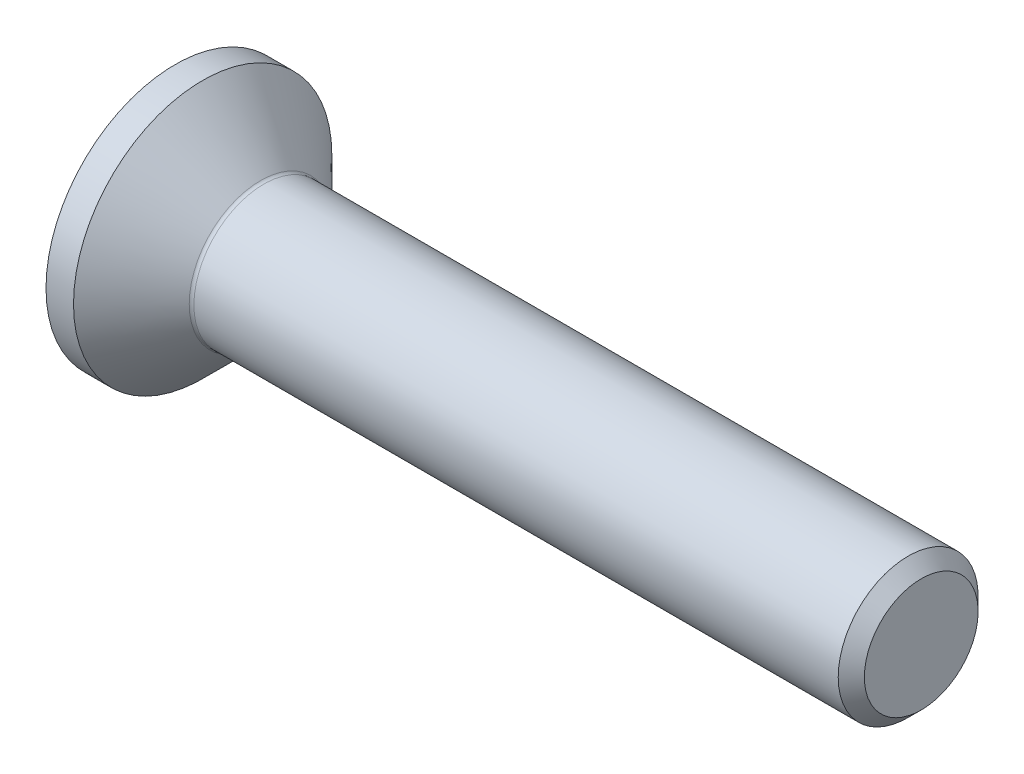
ISO-10303-21;
HEADER;
FILE_DESCRIPTION(('STEP AP214'),'2;1');
FILE_NAME('part.step','',(''),(''),'','','');
FILE_SCHEMA(('AUTOMOTIVE_DESIGN { 1 0 10303 214 1 1 1 1 }'));
ENDSEC;
DATA;
#1=APPLICATION_CONTEXT('core data for automotive mechanical design processes');
#2=APPLICATION_PROTOCOL_DEFINITION('international standard','automotive_design',2000,#1);
#3=PRODUCT_CONTEXT('',#1,'mechanical');
#4=PRODUCT('Part','Part','',(#3));
#5=PRODUCT_RELATED_PRODUCT_CATEGORY('part','',(#4));
#6=PRODUCT_DEFINITION_FORMATION('','',#4);
#7=PRODUCT_DEFINITION_CONTEXT('part definition',#1,'design');
#8=PRODUCT_DEFINITION('design','',#6,#7);
#9=PRODUCT_DEFINITION_SHAPE('','',#8);
#10=(LENGTH_UNIT() NAMED_UNIT(*) SI_UNIT(.MILLI.,.METRE.));
#11=(NAMED_UNIT(*) PLANE_ANGLE_UNIT() SI_UNIT($,.RADIAN.));
#12=(NAMED_UNIT(*) SI_UNIT($,.STERADIAN.) SOLID_ANGLE_UNIT());
#13=UNCERTAINTY_MEASURE_WITH_UNIT(LENGTH_MEASURE(1.E-05),#10,'distance_accuracy_value','');
#14=(GEOMETRIC_REPRESENTATION_CONTEXT(3) GLOBAL_UNCERTAINTY_ASSIGNED_CONTEXT((#13)) GLOBAL_UNIT_ASSIGNED_CONTEXT((#10,
#11,#12)) REPRESENTATION_CONTEXT('',''));
#15=CARTESIAN_POINT('',(0.,0.,0.));
#16=DIRECTION('',(0.,0.,1.));
#17=DIRECTION('',(1.,0.,0.));
#18=AXIS2_PLACEMENT_3D('',#15,#16,#17);
#19=CARTESIAN_POINT('',(0.,0.,0.));
#20=DIRECTION('',(-1.,0.,0.));
#21=DIRECTION('',(0.,0.,1.));
#22=AXIS2_PLACEMENT_3D('',#19,#20,#21);
#23=PLANE('',#22);
#24=CARTESIAN_POINT('',(0.,0.,0.));
#25=DIRECTION('',(-1.,0.,0.));
#26=DIRECTION('',(0.,0.,1.));
#27=AXIS2_PLACEMENT_3D('',#24,#25,#26);
#28=CIRCLE('',#27,2.77);
#29=CARTESIAN_POINT('',(0.,0.,2.77));
#30=VERTEX_POINT('',#29);
#31=EDGE_CURVE('E155',#30,#30,#28,.T.);
#32=ORIENTED_EDGE('',*,*,#31,.T.);
#33=EDGE_LOOP('',(#32));
#34=FACE_BOUND('',#33,.T.);
#35=DIRECTION('',(0.,-0.5,-0.866025403784439));
#36=VECTOR('',#35,1.);
#37=CARTESIAN_POINT('',(0.,-0.577350269189625,1.));
#38=LINE('',#37,#36);
#39=CARTESIAN_POINT('',(0.,-0.577350269189625,1.));
#40=VERTEX_POINT('',#39);
#41=CARTESIAN_POINT('',(0.,-1.15470053837925,0.));
#42=VERTEX_POINT('',#41);
#43=EDGE_CURVE('E121',#40,#42,#38,.T.);
#44=ORIENTED_EDGE('',*,*,#43,.T.);
#45=DIRECTION('',(0.,0.5,-0.866025403784439));
#46=VECTOR('',#45,1.);
#47=CARTESIAN_POINT('',(0.,-1.15470053837925,0.));
#48=LINE('',#47,#46);
#49=CARTESIAN_POINT('',(0.,-0.577350269189625,-1.));
#50=VERTEX_POINT('',#49);
#51=EDGE_CURVE('E52',#42,#50,#48,.T.);
#52=ORIENTED_EDGE('',*,*,#51,.T.);
#53=DIRECTION('',(0.,1.,0.));
#54=VECTOR('',#53,1.);
#55=CARTESIAN_POINT('',(0.,-0.577350269189625,-1.));
#56=LINE('',#55,#54);
#57=CARTESIAN_POINT('',(0.,0.577350269189626,-1.));
#58=VERTEX_POINT('',#57);
#59=EDGE_CURVE('E132',#50,#58,#56,.T.);
#60=ORIENTED_EDGE('',*,*,#59,.T.);
#61=DIRECTION('',(0.,0.500000000000001,0.866025403784438));
#62=VECTOR('',#61,1.);
#63=CARTESIAN_POINT('',(0.,0.577350269189626,-1.));
#64=LINE('',#63,#62);
#65=CARTESIAN_POINT('',(0.,1.15470053837925,0.));
#66=VERTEX_POINT('',#65);
#67=EDGE_CURVE('E256',#58,#66,#64,.T.);
#68=ORIENTED_EDGE('',*,*,#67,.T.);
#69=DIRECTION('',(0.,-0.5,0.866025403784438));
#70=VECTOR('',#69,1.);
#71=CARTESIAN_POINT('',(0.,1.15470053837925,0.));
#72=LINE('',#71,#70);
#73=CARTESIAN_POINT('',(0.,0.577350269189626,1.));
#74=VERTEX_POINT('',#73);
#75=EDGE_CURVE('E259',#66,#74,#72,.T.);
#76=ORIENTED_EDGE('',*,*,#75,.T.);
#77=DIRECTION('',(0.,-1.,0.));
#78=VECTOR('',#77,1.);
#79=CARTESIAN_POINT('',(0.,0.577350269189626,1.));
#80=LINE('',#79,#78);
#81=EDGE_CURVE('E262',#74,#40,#80,.T.);
#82=ORIENTED_EDGE('',*,*,#81,.T.);
#83=EDGE_LOOP('',(#44,#52,#60,#68,#76,#82));
#84=FACE_BOUND('',#83,.T.);
#85=ADVANCED_FACE('F37',(#34,#84),#23,.T.);
#86=CARTESIAN_POINT('',(0.,0.,0.));
#87=DIRECTION('',(-1.,0.,0.));
#88=DIRECTION('',(0.,0.,1.));
#89=AXIS2_PLACEMENT_3D('',#86,#87,#88);
#90=CYLINDRICAL_SURFACE('',#89,2.77);
#91=CARTESIAN_POINT('',(0.590000000000007,0.,0.));
#92=DIRECTION('',(-1.,0.,0.));
#93=DIRECTION('',(0.,0.,1.));
#94=AXIS2_PLACEMENT_3D('',#91,#92,#93);
#95=CIRCLE('',#94,2.77);
#96=CARTESIAN_POINT('',(0.590000000000007,0.,2.77));
#97=VERTEX_POINT('',#96);
#98=EDGE_CURVE('E152',#97,#97,#95,.T.);
#99=ORIENTED_EDGE('',*,*,#98,.T.);
#100=EDGE_LOOP('',(#99));
#101=FACE_BOUND('',#100,.T.);
#102=ORIENTED_EDGE('',*,*,#31,.F.);
#103=EDGE_LOOP('',(#102));
#104=FACE_BOUND('',#103,.T.);
#105=ADVANCED_FACE('F176',(#101,#104),#90,.T.);
#106=CARTESIAN_POINT('',(0.590000000000007,0.,0.));
#107=DIRECTION('',(-1.,0.,0.));
#108=DIRECTION('',(0.,0.,1.));
#109=AXIS2_PLACEMENT_3D('',#106,#107,#108);
#110=CONICAL_SURFACE('',#109,2.77,0.78539816339745);
#111=CARTESIAN_POINT('',(1.83071067811866,0.,0.));
#112=DIRECTION('',(-1.,0.,0.));
#113=DIRECTION('',(0.,0.,1.));
#114=AXIS2_PLACEMENT_3D('',#111,#112,#113);
#115=CIRCLE('',#114,1.52928932188135);
#116=CARTESIAN_POINT('',(1.83071067811866,0.,1.52928932188135));
#117=VERTEX_POINT('',#116);
#118=EDGE_CURVE('E45',#117,#117,#115,.T.);
#119=ORIENTED_EDGE('',*,*,#118,.T.);
#120=EDGE_LOOP('',(#119));
#121=FACE_BOUND('',#120,.T.);
#122=ORIENTED_EDGE('',*,*,#98,.F.);
#123=EDGE_LOOP('',(#122));
#124=FACE_BOUND('',#123,.T.);
#125=ADVANCED_FACE('F160',(#121,#124),#110,.T.);
#126=CARTESIAN_POINT('',(0.,0.,0.));
#127=DIRECTION('',(-1.,0.,0.));
#128=DIRECTION('',(0.,0.,1.));
#129=AXIS2_PLACEMENT_3D('',#126,#127,#128);
#130=CYLINDRICAL_SURFACE('',#129,1.5);
#131=CARTESIAN_POINT('',(1.90142135623731,0.,0.));
#132=DIRECTION('',(-1.,0.,0.));
#133=DIRECTION('',(0.,0.,1.));
#134=AXIS2_PLACEMENT_3D('',#131,#132,#133);
#135=CIRCLE('',#134,1.5);
#136=CARTESIAN_POINT('',(1.90142135623731,0.,1.5));
#137=VERTEX_POINT('',#136);
#138=EDGE_CURVE('E11',#137,#137,#135,.F.);
#139=ORIENTED_EDGE('',*,*,#138,.T.);
#140=EDGE_LOOP('',(#139));
#141=FACE_BOUND('',#140,.T.);
#142=CARTESIAN_POINT('',(15.7195,0.,0.));
#143=DIRECTION('',(-1.,0.,0.));
#144=DIRECTION('',(0.,0.,1.));
#145=AXIS2_PLACEMENT_3D('',#142,#143,#144);
#146=CIRCLE('',#145,1.5);
#147=CARTESIAN_POINT('',(15.7195,0.,1.5));
#148=VERTEX_POINT('',#147);
#149=EDGE_CURVE('E149',#148,#148,#146,.T.);
#150=ORIENTED_EDGE('',*,*,#149,.T.);
#151=EDGE_LOOP('',(#150));
#152=FACE_BOUND('',#151,.T.);
#153=ADVANCED_FACE('F187',(#141,#152),#130,.T.);
#154=CARTESIAN_POINT('',(16.,0.,0.));
#155=DIRECTION('',(-1.,0.,0.));
#156=DIRECTION('',(0.,0.,1.));
#157=AXIS2_PLACEMENT_3D('',#154,#155,#156);
#158=CONICAL_SURFACE('',#157,1.2195,0.785398163397475);
#159=ORIENTED_EDGE('',*,*,#149,.F.);
#160=EDGE_LOOP('',(#159));
#161=FACE_BOUND('',#160,.T.);
#162=CARTESIAN_POINT('',(16.,0.,0.));
#163=DIRECTION('',(-1.,0.,0.));
#164=DIRECTION('',(0.,0.,1.));
#165=AXIS2_PLACEMENT_3D('',#162,#163,#164);
#166=CIRCLE('',#165,1.2195);
#167=CARTESIAN_POINT('',(16.,0.,1.2195));
#168=VERTEX_POINT('',#167);
#169=EDGE_CURVE('E145',#168,#168,#166,.T.);
#170=ORIENTED_EDGE('',*,*,#169,.T.);
#171=EDGE_LOOP('',(#170));
#172=FACE_BOUND('',#171,.T.);
#173=ADVANCED_FACE('F171',(#161,#172),#158,.T.);
#174=CARTESIAN_POINT('',(16.,1.2195,0.));
#175=DIRECTION('',(1.,0.,0.));
#176=DIRECTION('',(0.,0.,-1.));
#177=AXIS2_PLACEMENT_3D('',#174,#175,#176);
#178=PLANE('',#177);
#179=ORIENTED_EDGE('',*,*,#169,.F.);
#180=EDGE_LOOP('',(#179));
#181=FACE_BOUND('',#180,.T.);
#182=ADVANCED_FACE('F164',(#181),#178,.T.);
#183=CARTESIAN_POINT('',(1.90142135623731,0.,0.));
#184=DIRECTION('',(-1.,0.,0.));
#185=DIRECTION('',(0.,0.,1.));
#186=AXIS2_PLACEMENT_3D('',#183,#184,#185);
#187=TOROIDAL_SURFACE('',#186,1.6,0.1);
#188=ORIENTED_EDGE('',*,*,#138,.F.);
#189=EDGE_LOOP('',(#188));
#190=FACE_BOUND('',#189,.T.);
#191=ORIENTED_EDGE('',*,*,#118,.F.);
#192=EDGE_LOOP('',(#191));
#193=FACE_BOUND('',#192,.T.);
#194=ADVANCED_FACE('F39',(#190,#193),#187,.F.);
#195=CARTESIAN_POINT('',(1.1,-1.15470053837925,0.));
#196=DIRECTION('',(0.,0.866025403784439,0.5));
#197=DIRECTION('',(0.,-0.5,0.866025403784439));
#198=AXIS2_PLACEMENT_3D('',#195,#196,#197);
#199=PLANE('',#198);
#200=ORIENTED_EDGE('',*,*,#51,.F.);
#201=DIRECTION('',(-1.,0.,0.));
#202=VECTOR('',#201,1.);
#203=CARTESIAN_POINT('',(1.1,-1.15470053837925,0.));
#204=LINE('',#203,#202);
#205=CARTESIAN_POINT('',(1.1,-1.15470053837925,0.));
#206=VERTEX_POINT('',#205);
#207=EDGE_CURVE('E253',#206,#42,#204,.T.);
#208=ORIENTED_EDGE('',*,*,#207,.F.);
#209=DIRECTION('',(0.,0.5,-0.866025403784439));
#210=VECTOR('',#209,1.);
#211=CARTESIAN_POINT('',(1.1,-1.15470053837925,0.));
#212=LINE('',#211,#210);
#213=CARTESIAN_POINT('',(1.1,-0.866025403784438,-0.5));
#214=VERTEX_POINT('',#213);
#215=EDGE_CURVE('E117',#206,#214,#212,.T.);
#216=ORIENTED_EDGE('',*,*,#215,.T.);
#217=CARTESIAN_POINT('',(1.1,-0.577350269189625,-1.));
#218=VERTEX_POINT('',#217);
#219=EDGE_CURVE('E113',#214,#218,#212,.T.);
#220=ORIENTED_EDGE('',*,*,#219,.T.);
#221=DIRECTION('',(-1.,0.,0.));
#222=VECTOR('',#221,1.);
#223=CARTESIAN_POINT('',(1.1,-0.577350269189625,-1.));
#224=LINE('',#223,#222);
#225=EDGE_CURVE('E115',#218,#50,#224,.T.);
#226=ORIENTED_EDGE('',*,*,#225,.T.);
#227=EDGE_LOOP('',(#200,#208,#216,#220,#226));
#228=FACE_BOUND('',#227,.T.);
#229=ADVANCED_FACE('F114',(#228),#199,.T.);
#230=CARTESIAN_POINT('',(1.1,-0.577350269189625,-1.));
#231=DIRECTION('',(0.,0.,1.));
#232=DIRECTION('',(1.,0.,0.));
#233=AXIS2_PLACEMENT_3D('',#230,#231,#232);
#234=PLANE('',#233);
#235=ORIENTED_EDGE('',*,*,#59,.F.);
#236=ORIENTED_EDGE('',*,*,#225,.F.);
#237=DIRECTION('',(0.,1.,0.));
#238=VECTOR('',#237,1.);
#239=CARTESIAN_POINT('',(1.1,-0.577350269189625,-1.));
#240=LINE('',#239,#238);
#241=CARTESIAN_POINT('',(1.1,0.,-1.));
#242=VERTEX_POINT('',#241);
#243=EDGE_CURVE('E60',#218,#242,#240,.T.);
#244=ORIENTED_EDGE('',*,*,#243,.T.);
#245=CARTESIAN_POINT('',(1.1,0.577350269189626,-1.));
#246=VERTEX_POINT('',#245);
#247=EDGE_CURVE('E127',#242,#246,#240,.T.);
#248=ORIENTED_EDGE('',*,*,#247,.T.);
#249=DIRECTION('',(-1.,0.,0.));
#250=VECTOR('',#249,1.);
#251=CARTESIAN_POINT('',(1.1,0.577350269189626,-1.));
#252=LINE('',#251,#250);
#253=EDGE_CURVE('E134',#246,#58,#252,.T.);
#254=ORIENTED_EDGE('',*,*,#253,.T.);
#255=EDGE_LOOP('',(#235,#236,#244,#248,#254));
#256=FACE_BOUND('',#255,.T.);
#257=ADVANCED_FACE('F129',(#256),#234,.T.);
#258=CARTESIAN_POINT('',(1.1,0.577350269189626,-1.));
#259=DIRECTION('',(0.,-0.866025403784438,0.500000000000001));
#260=DIRECTION('',(0.,-0.500000000000001,-0.866025403784438));
#261=AXIS2_PLACEMENT_3D('',#258,#259,#260);
#262=PLANE('',#261);
#263=ORIENTED_EDGE('',*,*,#67,.F.);
#264=ORIENTED_EDGE('',*,*,#253,.F.);
#265=DIRECTION('',(0.,0.500000000000001,0.866025403784438));
#266=VECTOR('',#265,1.);
#267=CARTESIAN_POINT('',(1.1,0.577350269189626,-1.));
#268=LINE('',#267,#266);
#269=CARTESIAN_POINT('',(1.1,0.866025403784439,-0.500000000000001));
#270=VERTEX_POINT('',#269);
#271=EDGE_CURVE('E234',#246,#270,#268,.T.);
#272=ORIENTED_EDGE('',*,*,#271,.T.);
#273=CARTESIAN_POINT('',(1.1,1.15470053837925,0.));
#274=VERTEX_POINT('',#273);
#275=EDGE_CURVE('E126',#270,#274,#268,.T.);
#276=ORIENTED_EDGE('',*,*,#275,.T.);
#277=DIRECTION('',(-1.,0.,0.));
#278=VECTOR('',#277,1.);
#279=CARTESIAN_POINT('',(1.1,1.15470053837925,0.));
#280=LINE('',#279,#278);
#281=EDGE_CURVE('E140',#274,#66,#280,.T.);
#282=ORIENTED_EDGE('',*,*,#281,.T.);
#283=EDGE_LOOP('',(#263,#264,#272,#276,#282));
#284=FACE_BOUND('',#283,.T.);
#285=ADVANCED_FACE('F201',(#284),#262,.T.);
#286=CARTESIAN_POINT('',(1.1,1.15470053837925,0.));
#287=DIRECTION('',(0.,-0.866025403784438,-0.5));
#288=DIRECTION('',(0.,0.5,-0.866025403784438));
#289=AXIS2_PLACEMENT_3D('',#286,#287,#288);
#290=PLANE('',#289);
#291=ORIENTED_EDGE('',*,*,#75,.F.);
#292=ORIENTED_EDGE('',*,*,#281,.F.);
#293=DIRECTION('',(0.,-0.5,0.866025403784438));
#294=VECTOR('',#293,1.);
#295=CARTESIAN_POINT('',(1.1,1.15470053837925,0.));
#296=LINE('',#295,#294);
#297=CARTESIAN_POINT('',(1.1,0.866025403784439,0.500000000000001));
#298=VERTEX_POINT('',#297);
#299=EDGE_CURVE('E241',#274,#298,#296,.T.);
#300=ORIENTED_EDGE('',*,*,#299,.T.);
#301=CARTESIAN_POINT('',(1.1,0.577350269189626,1.));
#302=VERTEX_POINT('',#301);
#303=EDGE_CURVE('E239',#298,#302,#296,.T.);
#304=ORIENTED_EDGE('',*,*,#303,.T.);
#305=DIRECTION('',(-1.,0.,0.));
#306=VECTOR('',#305,1.);
#307=CARTESIAN_POINT('',(1.1,0.577350269189626,1.));
#308=LINE('',#307,#306);
#309=EDGE_CURVE('E271',#302,#74,#308,.T.);
#310=ORIENTED_EDGE('',*,*,#309,.T.);
#311=EDGE_LOOP('',(#291,#292,#300,#304,#310));
#312=FACE_BOUND('',#311,.T.);
#313=ADVANCED_FACE('F204',(#312),#290,.T.);
#314=CARTESIAN_POINT('',(1.1,0.577350269189626,1.));
#315=DIRECTION('',(0.,0.,-1.));
#316=DIRECTION('',(-1.,0.,0.));
#317=AXIS2_PLACEMENT_3D('',#314,#315,#316);
#318=PLANE('',#317);
#319=ORIENTED_EDGE('',*,*,#81,.F.);
#320=ORIENTED_EDGE('',*,*,#309,.F.);
#321=DIRECTION('',(0.,-1.,0.));
#322=VECTOR('',#321,1.);
#323=CARTESIAN_POINT('',(1.1,0.577350269189626,1.));
#324=LINE('',#323,#322);
#325=CARTESIAN_POINT('',(1.1,0.,1.));
#326=VERTEX_POINT('',#325);
#327=EDGE_CURVE('E246',#302,#326,#324,.T.);
#328=ORIENTED_EDGE('',*,*,#327,.T.);
#329=CARTESIAN_POINT('',(1.1,-0.577350269189625,1.));
#330=VERTEX_POINT('',#329);
#331=EDGE_CURVE('E245',#326,#330,#324,.T.);
#332=ORIENTED_EDGE('',*,*,#331,.T.);
#333=DIRECTION('',(-1.,0.,0.));
#334=VECTOR('',#333,1.);
#335=CARTESIAN_POINT('',(1.1,-0.577350269189625,1.));
#336=LINE('',#335,#334);
#337=EDGE_CURVE('E268',#330,#40,#336,.T.);
#338=ORIENTED_EDGE('',*,*,#337,.T.);
#339=EDGE_LOOP('',(#319,#320,#328,#332,#338));
#340=FACE_BOUND('',#339,.T.);
#341=ADVANCED_FACE('F208',(#340),#318,.T.);
#342=CARTESIAN_POINT('',(1.1,-0.577350269189625,1.));
#343=DIRECTION('',(0.,0.866025403784439,-0.5));
#344=DIRECTION('',(0.,0.5,0.866025403784439));
#345=AXIS2_PLACEMENT_3D('',#342,#343,#344);
#346=PLANE('',#345);
#347=ORIENTED_EDGE('',*,*,#43,.F.);
#348=ORIENTED_EDGE('',*,*,#337,.F.);
#349=DIRECTION('',(0.,-0.5,-0.866025403784439));
#350=VECTOR('',#349,1.);
#351=CARTESIAN_POINT('',(1.1,-0.577350269189625,1.));
#352=LINE('',#351,#350);
#353=CARTESIAN_POINT('',(1.1,-0.866025403784438,0.5));
#354=VERTEX_POINT('',#353);
#355=EDGE_CURVE('E250',#330,#354,#352,.T.);
#356=ORIENTED_EDGE('',*,*,#355,.T.);
#357=EDGE_CURVE('E249',#354,#206,#352,.T.);
#358=ORIENTED_EDGE('',*,*,#357,.T.);
#359=ORIENTED_EDGE('',*,*,#207,.T.);
#360=EDGE_LOOP('',(#347,#348,#356,#358,#359));
#361=FACE_BOUND('',#360,.T.);
#362=ADVANCED_FACE('F212',(#361),#346,.T.);
#363=CARTESIAN_POINT('',(1.1,0.,-2.));
#364=DIRECTION('',(1.,0.,0.));
#365=DIRECTION('',(0.,0.,-1.));
#366=AXIS2_PLACEMENT_3D('',#363,#364,#365);
#367=PLANE('',#366);
#368=ORIENTED_EDGE('',*,*,#243,.F.);
#369=ORIENTED_EDGE('',*,*,#219,.F.);
#370=CARTESIAN_POINT('',(1.1,0.,0.));
#371=DIRECTION('',(-1.,0.,0.));
#372=DIRECTION('',(0.,0.,1.));
#373=AXIS2_PLACEMENT_3D('',#370,#371,#372);
#374=CIRCLE('',#373,1.);
#375=EDGE_CURVE('E124',#242,#214,#374,.T.);
#376=ORIENTED_EDGE('',*,*,#375,.F.);
#377=EDGE_LOOP('',(#368,#369,#376));
#378=FACE_BOUND('',#377,.T.);
#379=ADVANCED_FACE('F123',(#378),#367,.F.);
#380=ORIENTED_EDGE('',*,*,#215,.F.);
#381=ORIENTED_EDGE('',*,*,#357,.F.);
#382=EDGE_CURVE('E137',#214,#354,#374,.T.);
#383=ORIENTED_EDGE('',*,*,#382,.F.);
#384=EDGE_LOOP('',(#380,#381,#383));
#385=FACE_BOUND('',#384,.T.);
#386=ADVANCED_FACE('F218',(#385),#367,.F.);
#387=ORIENTED_EDGE('',*,*,#355,.F.);
#388=ORIENTED_EDGE('',*,*,#331,.F.);
#389=EDGE_CURVE('E133',#354,#326,#374,.T.);
#390=ORIENTED_EDGE('',*,*,#389,.F.);
#391=EDGE_LOOP('',(#387,#388,#390));
#392=FACE_BOUND('',#391,.T.);
#393=ADVANCED_FACE('F222',(#392),#367,.F.);
#394=ORIENTED_EDGE('',*,*,#327,.F.);
#395=ORIENTED_EDGE('',*,*,#303,.F.);
#396=EDGE_CURVE('E139',#326,#298,#374,.T.);
#397=ORIENTED_EDGE('',*,*,#396,.F.);
#398=EDGE_LOOP('',(#394,#395,#397));
#399=FACE_BOUND('',#398,.T.);
#400=ADVANCED_FACE('F230',(#399),#367,.F.);
#401=ORIENTED_EDGE('',*,*,#299,.F.);
#402=ORIENTED_EDGE('',*,*,#275,.F.);
#403=EDGE_CURVE('E146',#298,#270,#374,.T.);
#404=ORIENTED_EDGE('',*,*,#403,.F.);
#405=EDGE_LOOP('',(#401,#402,#404));
#406=FACE_BOUND('',#405,.T.);
#407=ADVANCED_FACE('F225',(#406),#367,.F.);
#408=ORIENTED_EDGE('',*,*,#271,.F.);
#409=ORIENTED_EDGE('',*,*,#247,.F.);
#410=EDGE_CURVE('E235',#270,#242,#374,.T.);
#411=ORIENTED_EDGE('',*,*,#410,.F.);
#412=EDGE_LOOP('',(#408,#409,#411));
#413=FACE_BOUND('',#412,.T.);
#414=ADVANCED_FACE('F196',(#413),#367,.F.);
#415=CARTESIAN_POINT('',(1.1,0.,0.));
#416=DIRECTION('',(-1.,0.,0.));
#417=DIRECTION('',(0.,0.,1.));
#418=AXIS2_PLACEMENT_3D('',#415,#416,#417);
#419=CONICAL_SURFACE('',#418,1.,1.04719755119659);
#420=CARTESIAN_POINT('',(1.67735026918963,0.,0.));
#421=VERTEX_POINT('',#420);
#422=VERTEX_LOOP('',#421);
#423=FACE_BOUND('',#422,.T.);
#424=ORIENTED_EDGE('',*,*,#396,.T.);
#425=ORIENTED_EDGE('',*,*,#403,.T.);
#426=ORIENTED_EDGE('',*,*,#410,.T.);
#427=ORIENTED_EDGE('',*,*,#375,.T.);
#428=ORIENTED_EDGE('',*,*,#382,.T.);
#429=ORIENTED_EDGE('',*,*,#389,.T.);
#430=EDGE_LOOP('',(#424,#425,#426,#427,#428,#429));
#431=FACE_BOUND('',#430,.T.);
#432=ADVANCED_FACE('F194',(#423,#431),#419,.F.);
#433=CLOSED_SHELL('',(#85,#105,#125,#153,#173,#182,#194,#229,#257,#285,#313,#341,#362,#379,#386,
#393,#400,#407,#414,#432));
#434=MANIFOLD_SOLID_BREP('B2',#433);
#435=ADVANCED_BREP_SHAPE_REPRESENTATION('',(#18,#434),#14);
#436=SHAPE_DEFINITION_REPRESENTATION(#9,#435);
ENDSEC;
END-ISO-10303-21;
